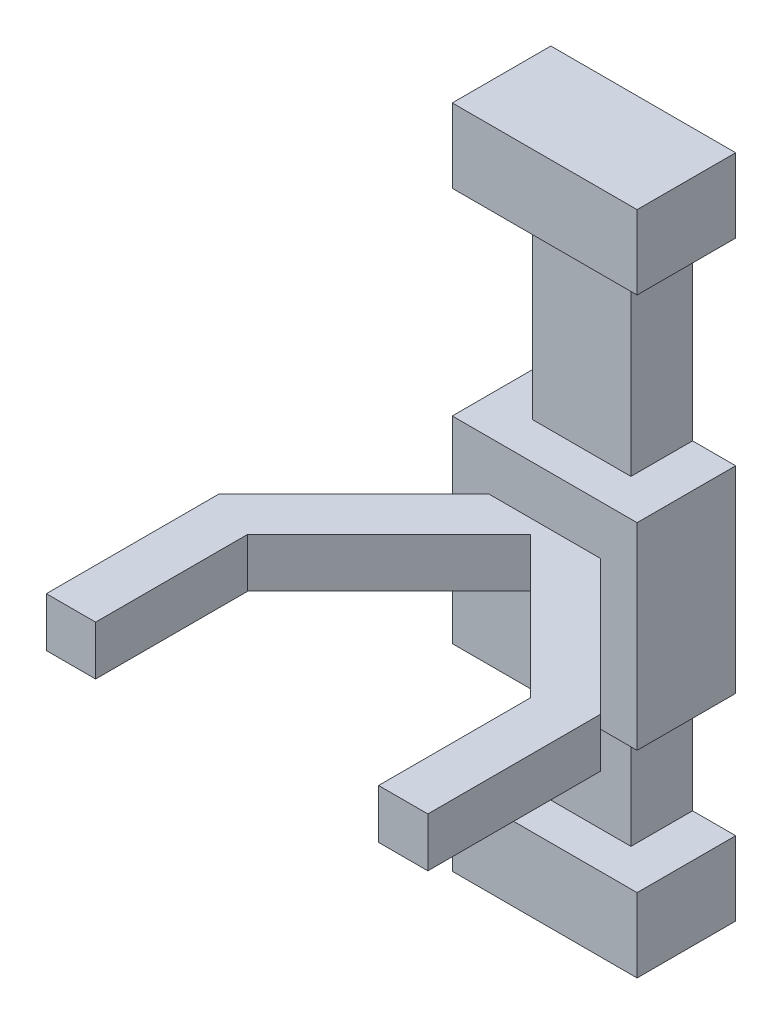
ISO-10303-21;
HEADER;
FILE_DESCRIPTION(('STEP AP214'),'2;1');
FILE_NAME('part.step','',(''),(''),'','','');
FILE_SCHEMA(('AUTOMOTIVE_DESIGN { 1 0 10303 214 1 1 1 1 }'));
ENDSEC;
DATA;
#1=APPLICATION_CONTEXT('core data for automotive mechanical design processes');
#2=APPLICATION_PROTOCOL_DEFINITION('international standard','automotive_design',2000,#1);
#3=PRODUCT_CONTEXT('',#1,'mechanical');
#4=PRODUCT('Part','Part','',(#3));
#5=PRODUCT_RELATED_PRODUCT_CATEGORY('part','',(#4));
#6=PRODUCT_DEFINITION_FORMATION('','',#4);
#7=PRODUCT_DEFINITION_CONTEXT('part definition',#1,'design');
#8=PRODUCT_DEFINITION('design','',#6,#7);
#9=PRODUCT_DEFINITION_SHAPE('','',#8);
#10=(LENGTH_UNIT() NAMED_UNIT(*) SI_UNIT(.MILLI.,.METRE.));
#11=(NAMED_UNIT(*) PLANE_ANGLE_UNIT() SI_UNIT($,.RADIAN.));
#12=(NAMED_UNIT(*) SI_UNIT($,.STERADIAN.) SOLID_ANGLE_UNIT());
#13=UNCERTAINTY_MEASURE_WITH_UNIT(LENGTH_MEASURE(1.E-05),#10,'distance_accuracy_value','');
#14=(GEOMETRIC_REPRESENTATION_CONTEXT(3) GLOBAL_UNCERTAINTY_ASSIGNED_CONTEXT((#13)) GLOBAL_UNIT_ASSIGNED_CONTEXT((#10,
#11,#12)) REPRESENTATION_CONTEXT('',''));
#15=CARTESIAN_POINT('',(0.,0.,0.));
#16=DIRECTION('',(0.,0.,1.));
#17=DIRECTION('',(1.,0.,0.));
#18=AXIS2_PLACEMENT_3D('',#15,#16,#17);
#19=CARTESIAN_POINT('',(83.262716319083,0.,108.942911165688));
#20=DIRECTION('',(-0.707106781186547,0.,0.707106781186547));
#21=DIRECTION('',(0.707106781186548,0.,0.707106781186547));
#22=AXIS2_PLACEMENT_3D('',#19,#20,#21);
#23=PLANE('',#22);
#24=DIRECTION('',(-0.707106781186547,0.,-0.707106781186547));
#25=VECTOR('',#24,1.);
#26=CARTESIAN_POINT('',(83.262716319083,90.,108.942911165688));
#27=LINE('',#26,#25);
#28=CARTESIAN_POINT('',(77.404851942814,90.,103.085046789419));
#29=VERTEX_POINT('',#28);
#30=CARTESIAN_POINT('',(20.,90.,45.6801948466053));
#31=VERTEX_POINT('',#30);
#32=EDGE_CURVE('E55',#29,#31,#27,.T.);
#33=ORIENTED_EDGE('',*,*,#32,.F.);
#34=DIRECTION('',(0.,1.,0.));
#35=VECTOR('',#34,1.);
#36=CARTESIAN_POINT('',(77.404851942814,0.,103.085046789419));
#37=LINE('',#36,#35);
#38=CARTESIAN_POINT('',(77.404851942814,110.,103.085046789419));
#39=VERTEX_POINT('',#38);
#40=EDGE_CURVE('E59',#29,#39,#37,.T.);
#41=ORIENTED_EDGE('',*,*,#40,.T.);
#42=DIRECTION('',(-0.707106781186547,0.,-0.707106781186547));
#43=VECTOR('',#42,1.);
#44=CARTESIAN_POINT('',(83.262716319083,110.,108.942911165688));
#45=LINE('',#44,#43);
#46=CARTESIAN_POINT('',(19.9999999999999,110.,45.6801948466053));
#47=VERTEX_POINT('',#46);
#48=EDGE_CURVE('E329',#39,#47,#45,.T.);
#49=ORIENTED_EDGE('',*,*,#48,.T.);
#50=DIRECTION('',(0.,1.,0.));
#51=VECTOR('',#50,1.);
#52=CARTESIAN_POINT('',(20.,0.,45.6801948466053));
#53=LINE('',#52,#51);
#54=EDGE_CURVE('E323',#31,#47,#53,.T.);
#55=ORIENTED_EDGE('',*,*,#54,.F.);
#56=EDGE_LOOP('',(#33,#41,#49,#55));
#57=FACE_BOUND('',#56,.T.);
#58=ADVANCED_FACE('F39',(#57),#23,.T.);
#59=CARTESIAN_POINT('',(-43.262716319083,0.,108.942911165688));
#60=DIRECTION('',(0.707106781186547,0.,0.707106781186547));
#61=DIRECTION('',(0.707106781186548,0.,-0.707106781186547));
#62=AXIS2_PLACEMENT_3D('',#59,#60,#61);
#63=PLANE('',#62);
#64=DIRECTION('',(0.707106781186547,0.,-0.707106781186547));
#65=VECTOR('',#64,1.);
#66=CARTESIAN_POINT('',(-43.262716319083,110.,108.942911165688));
#67=LINE('',#66,#65);
#68=CARTESIAN_POINT('',(-37.404851942814,110.,103.085046789419));
#69=VERTEX_POINT('',#68);
#70=EDGE_CURVE('E319',#69,#47,#67,.T.);
#71=ORIENTED_EDGE('',*,*,#70,.F.);
#72=DIRECTION('',(0.,-1.,0.));
#73=VECTOR('',#72,1.);
#74=CARTESIAN_POINT('',(-37.404851942814,0.,103.085046789419));
#75=LINE('',#74,#73);
#76=CARTESIAN_POINT('',(-37.404851942814,90.,103.085046789419));
#77=VERTEX_POINT('',#76);
#78=EDGE_CURVE('E11',#69,#77,#75,.T.);
#79=ORIENTED_EDGE('',*,*,#78,.T.);
#80=DIRECTION('',(0.707106781186547,0.,-0.707106781186547));
#81=VECTOR('',#80,1.);
#82=CARTESIAN_POINT('',(-43.262716319083,90.,108.942911165688));
#83=LINE('',#82,#81);
#84=EDGE_CURVE('E307',#77,#31,#83,.T.);
#85=ORIENTED_EDGE('',*,*,#84,.T.);
#86=ORIENTED_EDGE('',*,*,#54,.T.);
#87=EDGE_LOOP('',(#71,#79,#85,#86));
#88=FACE_BOUND('',#87,.T.);
#89=ADVANCED_FACE('F583',(#88),#63,.T.);
#90=CARTESIAN_POINT('',(0.,0.,25.));
#91=DIRECTION('',(1.,0.,0.));
#92=DIRECTION('',(0.,0.,-1.));
#93=AXIS2_PLACEMENT_3D('',#90,#91,#92);
#94=PLANE('',#93);
#95=DIRECTION('',(0.,0.,1.));
#96=VECTOR('',#95,1.);
#97=CARTESIAN_POINT('',(0.,50.,25.));
#98=LINE('',#97,#96);
#99=CARTESIAN_POINT('',(0.,50.,0.));
#100=VERTEX_POINT('',#99);
#101=CARTESIAN_POINT('',(0.,50.,25.));
#102=VERTEX_POINT('',#101);
#103=EDGE_CURVE('E396',#100,#102,#98,.T.);
#104=ORIENTED_EDGE('',*,*,#103,.F.);
#105=DIRECTION('',(0.,-1.,0.));
#106=VECTOR('',#105,1.);
#107=CARTESIAN_POINT('',(0.,0.,0.));
#108=LINE('',#107,#106);
#109=CARTESIAN_POINT('',(0.,0.,0.));
#110=VERTEX_POINT('',#109);
#111=EDGE_CURVE('E499',#100,#110,#108,.T.);
#112=ORIENTED_EDGE('',*,*,#111,.T.);
#113=DIRECTION('',(0.,0.,-1.));
#114=VECTOR('',#113,1.);
#115=CARTESIAN_POINT('',(0.,0.,25.));
#116=LINE('',#115,#114);
#117=CARTESIAN_POINT('',(0.,0.,25.));
#118=VERTEX_POINT('',#117);
#119=EDGE_CURVE('E532',#118,#110,#116,.T.);
#120=ORIENTED_EDGE('',*,*,#119,.F.);
#121=DIRECTION('',(0.,-1.,0.));
#122=VECTOR('',#121,1.);
#123=CARTESIAN_POINT('',(0.,0.,25.));
#124=LINE('',#123,#122);
#125=EDGE_CURVE('E505',#102,#118,#124,.T.);
#126=ORIENTED_EDGE('',*,*,#125,.F.);
#127=EDGE_LOOP('',(#104,#112,#120,#126));
#128=FACE_BOUND('',#127,.T.);
#129=ADVANCED_FACE('F604',(#128),#94,.F.);
#130=CARTESIAN_POINT('',(40.,0.,25.));
#131=DIRECTION('',(-1.,0.,0.));
#132=DIRECTION('',(0.,0.,1.));
#133=AXIS2_PLACEMENT_3D('',#130,#131,#132);
#134=PLANE('',#133);
#135=DIRECTION('',(0.,0.,-1.));
#136=VECTOR('',#135,1.);
#137=CARTESIAN_POINT('',(40.,50.,25.));
#138=LINE('',#137,#136);
#139=CARTESIAN_POINT('',(40.,50.,25.));
#140=VERTEX_POINT('',#139);
#141=CARTESIAN_POINT('',(40.,50.,0.));
#142=VERTEX_POINT('',#141);
#143=EDGE_CURVE('E392',#140,#142,#138,.T.);
#144=ORIENTED_EDGE('',*,*,#143,.F.);
#145=DIRECTION('',(0.,1.,0.));
#146=VECTOR('',#145,1.);
#147=CARTESIAN_POINT('',(40.,0.,25.));
#148=LINE('',#147,#146);
#149=CARTESIAN_POINT('',(40.,0.,25.));
#150=VERTEX_POINT('',#149);
#151=EDGE_CURVE('E509',#150,#140,#148,.T.);
#152=ORIENTED_EDGE('',*,*,#151,.F.);
#153=DIRECTION('',(0.,0.,-1.));
#154=VECTOR('',#153,1.);
#155=CARTESIAN_POINT('',(40.,0.,25.));
#156=LINE('',#155,#154);
#157=CARTESIAN_POINT('',(40.,0.,0.));
#158=VERTEX_POINT('',#157);
#159=EDGE_CURVE('E529',#150,#158,#156,.T.);
#160=ORIENTED_EDGE('',*,*,#159,.T.);
#161=DIRECTION('',(0.,1.,0.));
#162=VECTOR('',#161,1.);
#163=CARTESIAN_POINT('',(40.,0.,0.));
#164=LINE('',#163,#162);
#165=EDGE_CURVE('E520',#158,#142,#164,.T.);
#166=ORIENTED_EDGE('',*,*,#165,.T.);
#167=EDGE_LOOP('',(#144,#152,#160,#166));
#168=FACE_BOUND('',#167,.T.);
#169=ADVANCED_FACE('F678',(#168),#134,.F.);
#170=CARTESIAN_POINT('',(0.,0.,25.));
#171=DIRECTION('',(0.,0.,-1.));
#172=DIRECTION('',(-1.,0.,0.));
#173=AXIS2_PLACEMENT_3D('',#170,#171,#172);
#174=PLANE('',#173);
#175=DIRECTION('',(1.,0.,0.));
#176=VECTOR('',#175,1.);
#177=CARTESIAN_POINT('',(0.,50.,25.));
#178=LINE('',#177,#176);
#179=EDGE_CURVE('E388',#102,#140,#178,.T.);
#180=ORIENTED_EDGE('',*,*,#179,.F.);
#181=ORIENTED_EDGE('',*,*,#125,.T.);
#182=DIRECTION('',(1.,0.,0.));
#183=VECTOR('',#182,1.);
#184=CARTESIAN_POINT('',(0.,0.,25.));
#185=LINE('',#184,#183);
#186=EDGE_CURVE('E504',#118,#150,#185,.T.);
#187=ORIENTED_EDGE('',*,*,#186,.T.);
#188=ORIENTED_EDGE('',*,*,#151,.T.);
#189=EDGE_LOOP('',(#180,#181,#187,#188));
#190=FACE_BOUND('',#189,.T.);
#191=ADVANCED_FACE('F673',(#190),#174,.F.);
#192=CARTESIAN_POINT('',(0.,210.,0.));
#193=VERTEX_POINT('',#192);
#194=CARTESIAN_POINT('',(0.,130.,0.));
#195=VERTEX_POINT('',#194);
#196=EDGE_CURVE('E516',#193,#195,#108,.T.);
#197=ORIENTED_EDGE('',*,*,#196,.T.);
#198=DIRECTION('',(0.,0.,1.));
#199=VECTOR('',#198,1.);
#200=CARTESIAN_POINT('',(0.,130.,25.));
#201=LINE('',#200,#199);
#202=CARTESIAN_POINT('',(0.,130.,25.));
#203=VERTEX_POINT('',#202);
#204=EDGE_CURVE('E406',#195,#203,#201,.T.);
#205=ORIENTED_EDGE('',*,*,#204,.T.);
#206=CARTESIAN_POINT('',(0.,210.,25.));
#207=VERTEX_POINT('',#206);
#208=EDGE_CURVE('E500',#207,#203,#124,.T.);
#209=ORIENTED_EDGE('',*,*,#208,.F.);
#210=DIRECTION('',(0.,0.,-1.));
#211=VECTOR('',#210,1.);
#212=CARTESIAN_POINT('',(0.,210.,25.));
#213=LINE('',#212,#211);
#214=EDGE_CURVE('E515',#207,#193,#213,.T.);
#215=ORIENTED_EDGE('',*,*,#214,.T.);
#216=EDGE_LOOP('',(#197,#205,#209,#215));
#217=FACE_BOUND('',#216,.T.);
#218=ADVANCED_FACE('F41',(#217),#94,.F.);
#219=CARTESIAN_POINT('',(40.,130.,25.));
#220=VERTEX_POINT('',#219);
#221=CARTESIAN_POINT('',(40.,210.,25.));
#222=VERTEX_POINT('',#221);
#223=EDGE_CURVE('E508',#220,#222,#148,.T.);
#224=ORIENTED_EDGE('',*,*,#223,.F.);
#225=DIRECTION('',(0.,0.,-1.));
#226=VECTOR('',#225,1.);
#227=CARTESIAN_POINT('',(40.,130.,25.));
#228=LINE('',#227,#226);
#229=CARTESIAN_POINT('',(40.,130.,0.));
#230=VERTEX_POINT('',#229);
#231=EDGE_CURVE('E403',#220,#230,#228,.T.);
#232=ORIENTED_EDGE('',*,*,#231,.T.);
#233=CARTESIAN_POINT('',(40.,210.,0.));
#234=VERTEX_POINT('',#233);
#235=EDGE_CURVE('E519',#230,#234,#164,.T.);
#236=ORIENTED_EDGE('',*,*,#235,.T.);
#237=DIRECTION('',(0.,0.,-1.));
#238=VECTOR('',#237,1.);
#239=CARTESIAN_POINT('',(40.,210.,25.));
#240=LINE('',#239,#238);
#241=EDGE_CURVE('E525',#222,#234,#240,.T.);
#242=ORIENTED_EDGE('',*,*,#241,.F.);
#243=EDGE_LOOP('',(#224,#232,#236,#242));
#244=FACE_BOUND('',#243,.T.);
#245=ADVANCED_FACE('F671',(#244),#134,.F.);
#246=ORIENTED_EDGE('',*,*,#208,.T.);
#247=DIRECTION('',(1.,0.,0.));
#248=VECTOR('',#247,1.);
#249=CARTESIAN_POINT('',(0.,130.,25.));
#250=LINE('',#249,#248);
#251=EDGE_CURVE('E400',#203,#220,#250,.T.);
#252=ORIENTED_EDGE('',*,*,#251,.T.);
#253=ORIENTED_EDGE('',*,*,#223,.T.);
#254=DIRECTION('',(-1.,0.,0.));
#255=VECTOR('',#254,1.);
#256=CARTESIAN_POINT('',(0.,210.,25.));
#257=LINE('',#256,#255);
#258=EDGE_CURVE('E512',#222,#207,#257,.T.);
#259=ORIENTED_EDGE('',*,*,#258,.T.);
#260=EDGE_LOOP('',(#246,#252,#253,#259));
#261=FACE_BOUND('',#260,.T.);
#262=ADVANCED_FACE('F668',(#261),#174,.F.);
#263=CARTESIAN_POINT('',(0.,0.,0.));
#264=DIRECTION('',(0.,0.,-1.));
#265=DIRECTION('',(-1.,0.,0.));
#266=AXIS2_PLACEMENT_3D('',#263,#264,#265);
#267=PLANE('',#266);
#268=ORIENTED_EDGE('',*,*,#235,.F.);
#269=DIRECTION('',(1.,0.,0.));
#270=VECTOR('',#269,1.);
#271=CARTESIAN_POINT('',(0.,130.,0.));
#272=LINE('',#271,#270);
#273=CARTESIAN_POINT('',(57.5,130.,0.));
#274=VERTEX_POINT('',#273);
#275=EDGE_CURVE('E351',#230,#274,#272,.T.);
#276=ORIENTED_EDGE('',*,*,#275,.T.);
#277=DIRECTION('',(0.,-1.,0.));
#278=VECTOR('',#277,1.);
#279=CARTESIAN_POINT('',(57.5,130.,0.));
#280=LINE('',#279,#278);
#281=CARTESIAN_POINT('',(57.5,50.,0.));
#282=VERTEX_POINT('',#281);
#283=EDGE_CURVE('E380',#274,#282,#280,.T.);
#284=ORIENTED_EDGE('',*,*,#283,.T.);
#285=DIRECTION('',(1.,0.,0.));
#286=VECTOR('',#285,1.);
#287=CARTESIAN_POINT('',(0.,50.,0.));
#288=LINE('',#287,#286);
#289=EDGE_CURVE('E367',#142,#282,#288,.T.);
#290=ORIENTED_EDGE('',*,*,#289,.F.);
#291=ORIENTED_EDGE('',*,*,#165,.F.);
#292=DIRECTION('',(-1.,0.,0.));
#293=VECTOR('',#292,1.);
#294=CARTESIAN_POINT('',(0.,0.,0.));
#295=LINE('',#294,#293);
#296=CARTESIAN_POINT('',(57.5,0.,0.));
#297=VERTEX_POINT('',#296);
#298=EDGE_CURVE('E428',#297,#158,#295,.T.);
#299=ORIENTED_EDGE('',*,*,#298,.F.);
#300=DIRECTION('',(0.,1.,0.));
#301=VECTOR('',#300,1.);
#302=CARTESIAN_POINT('',(57.5,-30.,0.));
#303=LINE('',#302,#301);
#304=CARTESIAN_POINT('',(57.5,-30.,0.));
#305=VERTEX_POINT('',#304);
#306=EDGE_CURVE('E452',#305,#297,#303,.T.);
#307=ORIENTED_EDGE('',*,*,#306,.F.);
#308=DIRECTION('',(-1.,0.,0.));
#309=VECTOR('',#308,1.);
#310=CARTESIAN_POINT('',(0.,-30.,0.));
#311=LINE('',#310,#309);
#312=CARTESIAN_POINT('',(-17.5,-30.,0.));
#313=VERTEX_POINT('',#312);
#314=EDGE_CURVE('E410',#305,#313,#311,.T.);
#315=ORIENTED_EDGE('',*,*,#314,.T.);
#316=DIRECTION('',(0.,1.,0.));
#317=VECTOR('',#316,1.);
#318=CARTESIAN_POINT('',(-17.5,-30.,0.));
#319=LINE('',#318,#317);
#320=CARTESIAN_POINT('',(-17.5,0.,0.));
#321=VERTEX_POINT('',#320);
#322=EDGE_CURVE('E427',#313,#321,#319,.T.);
#323=ORIENTED_EDGE('',*,*,#322,.T.);
#324=EDGE_CURVE('E409',#110,#321,#295,.T.);
#325=ORIENTED_EDGE('',*,*,#324,.F.);
#326=ORIENTED_EDGE('',*,*,#111,.F.);
#327=CARTESIAN_POINT('',(-17.5,50.,0.));
#328=VERTEX_POINT('',#327);
#329=EDGE_CURVE('E368',#328,#100,#288,.T.);
#330=ORIENTED_EDGE('',*,*,#329,.F.);
#331=DIRECTION('',(0.,-1.,0.));
#332=VECTOR('',#331,1.);
#333=CARTESIAN_POINT('',(-17.5,130.,0.));
#334=LINE('',#333,#332);
#335=CARTESIAN_POINT('',(-17.5,130.,0.));
#336=VERTEX_POINT('',#335);
#337=EDGE_CURVE('E377',#336,#328,#334,.T.);
#338=ORIENTED_EDGE('',*,*,#337,.F.);
#339=EDGE_CURVE('E352',#336,#195,#272,.T.);
#340=ORIENTED_EDGE('',*,*,#339,.T.);
#341=ORIENTED_EDGE('',*,*,#196,.F.);
#342=DIRECTION('',(-1.,0.,0.));
#343=VECTOR('',#342,1.);
#344=CARTESIAN_POINT('',(0.,210.,0.));
#345=LINE('',#344,#343);
#346=CARTESIAN_POINT('',(-17.5,210.,0.));
#347=VERTEX_POINT('',#346);
#348=EDGE_CURVE('E475',#193,#347,#345,.T.);
#349=ORIENTED_EDGE('',*,*,#348,.T.);
#350=DIRECTION('',(0.,-1.,0.));
#351=VECTOR('',#350,1.);
#352=CARTESIAN_POINT('',(-17.5,240.,0.));
#353=LINE('',#352,#351);
#354=CARTESIAN_POINT('',(-17.5,240.,0.));
#355=VERTEX_POINT('',#354);
#356=EDGE_CURVE('E492',#355,#347,#353,.T.);
#357=ORIENTED_EDGE('',*,*,#356,.F.);
#358=DIRECTION('',(-1.,0.,0.));
#359=VECTOR('',#358,1.);
#360=CARTESIAN_POINT('',(0.,240.,0.));
#361=LINE('',#360,#359);
#362=CARTESIAN_POINT('',(57.5,240.,0.));
#363=VERTEX_POINT('',#362);
#364=EDGE_CURVE('E460',#363,#355,#361,.T.);
#365=ORIENTED_EDGE('',*,*,#364,.F.);
#366=DIRECTION('',(0.,-1.,0.));
#367=VECTOR('',#366,1.);
#368=CARTESIAN_POINT('',(57.5,240.,0.));
#369=LINE('',#368,#367);
#370=CARTESIAN_POINT('',(57.5,210.,0.));
#371=VERTEX_POINT('',#370);
#372=EDGE_CURVE('E496',#363,#371,#369,.T.);
#373=ORIENTED_EDGE('',*,*,#372,.T.);
#374=EDGE_CURVE('E476',#371,#234,#345,.T.);
#375=ORIENTED_EDGE('',*,*,#374,.T.);
#376=EDGE_LOOP('',(#268,#276,#284,#290,#291,#299,#307,#315,#323,#325,#326,#330,#338,#340,#341,
#349,#357,#365,#373,#375));
#377=FACE_BOUND('',#376,.T.);
#378=ADVANCED_FACE('F666',(#377),#267,.T.);
#379=CARTESIAN_POINT('',(57.5,240.,0.));
#380=DIRECTION('',(1.,0.,0.));
#381=DIRECTION('',(0.,0.,-1.));
#382=AXIS2_PLACEMENT_3D('',#379,#380,#381);
#383=PLANE('',#382);
#384=DIRECTION('',(0.,0.,1.));
#385=VECTOR('',#384,1.);
#386=CARTESIAN_POINT('',(57.5,210.,0.));
#387=LINE('',#386,#385);
#388=CARTESIAN_POINT('',(57.5,210.,40.));
#389=VERTEX_POINT('',#388);
#390=EDGE_CURVE('E455',#371,#389,#387,.T.);
#391=ORIENTED_EDGE('',*,*,#390,.F.);
#392=ORIENTED_EDGE('',*,*,#372,.F.);
#393=DIRECTION('',(0.,0.,1.));
#394=VECTOR('',#393,1.);
#395=CARTESIAN_POINT('',(57.5,240.,0.));
#396=LINE('',#395,#394);
#397=CARTESIAN_POINT('',(57.5,240.,40.));
#398=VERTEX_POINT('',#397);
#399=EDGE_CURVE('E456',#363,#398,#396,.T.);
#400=ORIENTED_EDGE('',*,*,#399,.T.);
#401=DIRECTION('',(0.,-1.,0.));
#402=VECTOR('',#401,1.);
#403=CARTESIAN_POINT('',(57.5,240.,40.));
#404=LINE('',#403,#402);
#405=EDGE_CURVE('E471',#398,#389,#404,.T.);
#406=ORIENTED_EDGE('',*,*,#405,.T.);
#407=EDGE_LOOP('',(#391,#392,#400,#406));
#408=FACE_BOUND('',#407,.T.);
#409=ADVANCED_FACE('F662',(#408),#383,.T.);
#410=CARTESIAN_POINT('',(-17.5,240.,0.));
#411=DIRECTION('',(1.,0.,0.));
#412=DIRECTION('',(0.,0.,-1.));
#413=AXIS2_PLACEMENT_3D('',#410,#411,#412);
#414=PLANE('',#413);
#415=DIRECTION('',(0.,0.,1.));
#416=VECTOR('',#415,1.);
#417=CARTESIAN_POINT('',(-17.5,210.,0.));
#418=LINE('',#417,#416);
#419=CARTESIAN_POINT('',(-17.5,210.,40.));
#420=VERTEX_POINT('',#419);
#421=EDGE_CURVE('E480',#347,#420,#418,.T.);
#422=ORIENTED_EDGE('',*,*,#421,.T.);
#423=DIRECTION('',(0.,-1.,0.));
#424=VECTOR('',#423,1.);
#425=CARTESIAN_POINT('',(-17.5,240.,40.));
#426=LINE('',#425,#424);
#427=CARTESIAN_POINT('',(-17.5,240.,40.));
#428=VERTEX_POINT('',#427);
#429=EDGE_CURVE('E489',#428,#420,#426,.T.);
#430=ORIENTED_EDGE('',*,*,#429,.F.);
#431=DIRECTION('',(0.,0.,1.));
#432=VECTOR('',#431,1.);
#433=CARTESIAN_POINT('',(-17.5,240.,0.));
#434=LINE('',#433,#432);
#435=EDGE_CURVE('E464',#355,#428,#434,.T.);
#436=ORIENTED_EDGE('',*,*,#435,.F.);
#437=ORIENTED_EDGE('',*,*,#356,.T.);
#438=EDGE_LOOP('',(#422,#430,#436,#437));
#439=FACE_BOUND('',#438,.T.);
#440=ADVANCED_FACE('F658',(#439),#414,.F.);
#441=CARTESIAN_POINT('',(0.,240.,40.));
#442=DIRECTION('',(0.,0.,1.));
#443=DIRECTION('',(1.,0.,0.));
#444=AXIS2_PLACEMENT_3D('',#441,#442,#443);
#445=PLANE('',#444);
#446=DIRECTION('',(-1.,0.,0.));
#447=VECTOR('',#446,1.);
#448=CARTESIAN_POINT('',(0.,210.,40.));
#449=LINE('',#448,#447);
#450=EDGE_CURVE('E461',#389,#420,#449,.T.);
#451=ORIENTED_EDGE('',*,*,#450,.F.);
#452=ORIENTED_EDGE('',*,*,#405,.F.);
#453=DIRECTION('',(-1.,0.,0.));
#454=VECTOR('',#453,1.);
#455=CARTESIAN_POINT('',(0.,240.,40.));
#456=LINE('',#455,#454);
#457=EDGE_CURVE('E467',#398,#428,#456,.T.);
#458=ORIENTED_EDGE('',*,*,#457,.T.);
#459=ORIENTED_EDGE('',*,*,#429,.T.);
#460=EDGE_LOOP('',(#451,#452,#458,#459));
#461=FACE_BOUND('',#460,.T.);
#462=ADVANCED_FACE('F651',(#461),#445,.T.);
#463=CARTESIAN_POINT('',(0.,240.,0.));
#464=DIRECTION('',(0.,1.,0.));
#465=DIRECTION('',(0.,0.,1.));
#466=AXIS2_PLACEMENT_3D('',#463,#464,#465);
#467=PLANE('',#466);
#468=ORIENTED_EDGE('',*,*,#399,.F.);
#469=ORIENTED_EDGE('',*,*,#364,.T.);
#470=ORIENTED_EDGE('',*,*,#435,.T.);
#471=ORIENTED_EDGE('',*,*,#457,.F.);
#472=EDGE_LOOP('',(#468,#469,#470,#471));
#473=FACE_BOUND('',#472,.T.);
#474=ADVANCED_FACE('F648',(#473),#467,.T.);
#475=CARTESIAN_POINT('',(0.,210.,0.));
#476=DIRECTION('',(0.,1.,0.));
#477=DIRECTION('',(0.,0.,1.));
#478=AXIS2_PLACEMENT_3D('',#475,#476,#477);
#479=PLANE('',#478);
#480=ORIENTED_EDGE('',*,*,#214,.F.);
#481=ORIENTED_EDGE('',*,*,#258,.F.);
#482=ORIENTED_EDGE('',*,*,#241,.T.);
#483=ORIENTED_EDGE('',*,*,#374,.F.);
#484=ORIENTED_EDGE('',*,*,#390,.T.);
#485=ORIENTED_EDGE('',*,*,#450,.T.);
#486=ORIENTED_EDGE('',*,*,#421,.F.);
#487=ORIENTED_EDGE('',*,*,#348,.F.);
#488=EDGE_LOOP('',(#480,#481,#482,#483,#484,#485,#486,#487));
#489=FACE_BOUND('',#488,.T.);
#490=ADVANCED_FACE('F646',(#489),#479,.F.);
#491=CARTESIAN_POINT('',(57.5,-30.,0.));
#492=DIRECTION('',(1.,0.,0.));
#493=DIRECTION('',(0.,0.,-1.));
#494=AXIS2_PLACEMENT_3D('',#491,#492,#493);
#495=PLANE('',#494);
#496=DIRECTION('',(0.,0.,-1.));
#497=VECTOR('',#496,1.);
#498=CARTESIAN_POINT('',(57.5,0.,0.));
#499=LINE('',#498,#497);
#500=CARTESIAN_POINT('',(57.5,0.,40.));
#501=VERTEX_POINT('',#500);
#502=EDGE_CURVE('E432',#501,#297,#499,.T.);
#503=ORIENTED_EDGE('',*,*,#502,.F.);
#504=DIRECTION('',(0.,1.,0.));
#505=VECTOR('',#504,1.);
#506=CARTESIAN_POINT('',(57.5,-30.,40.));
#507=LINE('',#506,#505);
#508=CARTESIAN_POINT('',(57.5,-30.,40.));
#509=VERTEX_POINT('',#508);
#510=EDGE_CURVE('E449',#509,#501,#507,.T.);
#511=ORIENTED_EDGE('',*,*,#510,.F.);
#512=DIRECTION('',(0.,0.,-1.));
#513=VECTOR('',#512,1.);
#514=CARTESIAN_POINT('',(57.5,-30.,0.));
#515=LINE('',#514,#513);
#516=EDGE_CURVE('E414',#509,#305,#515,.T.);
#517=ORIENTED_EDGE('',*,*,#516,.T.);
#518=ORIENTED_EDGE('',*,*,#306,.T.);
#519=EDGE_LOOP('',(#503,#511,#517,#518));
#520=FACE_BOUND('',#519,.T.);
#521=ADVANCED_FACE('F642',(#520),#495,.T.);
#522=CARTESIAN_POINT('',(0.,-30.,40.));
#523=DIRECTION('',(0.,0.,1.));
#524=DIRECTION('',(1.,0.,0.));
#525=AXIS2_PLACEMENT_3D('',#522,#523,#524);
#526=PLANE('',#525);
#527=DIRECTION('',(1.,0.,0.));
#528=VECTOR('',#527,1.);
#529=CARTESIAN_POINT('',(0.,0.,40.));
#530=LINE('',#529,#528);
#531=CARTESIAN_POINT('',(-17.5,0.,40.));
#532=VERTEX_POINT('',#531);
#533=EDGE_CURVE('E436',#532,#501,#530,.T.);
#534=ORIENTED_EDGE('',*,*,#533,.F.);
#535=DIRECTION('',(0.,1.,0.));
#536=VECTOR('',#535,1.);
#537=CARTESIAN_POINT('',(-17.5,-30.,40.));
#538=LINE('',#537,#536);
#539=CARTESIAN_POINT('',(-17.5,-30.,40.));
#540=VERTEX_POINT('',#539);
#541=EDGE_CURVE('E446',#540,#532,#538,.T.);
#542=ORIENTED_EDGE('',*,*,#541,.F.);
#543=DIRECTION('',(1.,0.,0.));
#544=VECTOR('',#543,1.);
#545=CARTESIAN_POINT('',(0.,-30.,40.));
#546=LINE('',#545,#544);
#547=EDGE_CURVE('E419',#540,#509,#546,.T.);
#548=ORIENTED_EDGE('',*,*,#547,.T.);
#549=ORIENTED_EDGE('',*,*,#510,.T.);
#550=EDGE_LOOP('',(#534,#542,#548,#549));
#551=FACE_BOUND('',#550,.T.);
#552=ADVANCED_FACE('F638',(#551),#526,.T.);
#553=CARTESIAN_POINT('',(-17.5,-30.,0.));
#554=DIRECTION('',(-1.,0.,0.));
#555=DIRECTION('',(0.,0.,1.));
#556=AXIS2_PLACEMENT_3D('',#553,#554,#555);
#557=PLANE('',#556);
#558=DIRECTION('',(0.,0.,1.));
#559=VECTOR('',#558,1.);
#560=CARTESIAN_POINT('',(-17.5,0.,0.));
#561=LINE('',#560,#559);
#562=EDGE_CURVE('E415',#321,#532,#561,.T.);
#563=ORIENTED_EDGE('',*,*,#562,.F.);
#564=ORIENTED_EDGE('',*,*,#322,.F.);
#565=DIRECTION('',(0.,0.,1.));
#566=VECTOR('',#565,1.);
#567=CARTESIAN_POINT('',(-17.5,-30.,0.));
#568=LINE('',#567,#566);
#569=EDGE_CURVE('E423',#313,#540,#568,.T.);
#570=ORIENTED_EDGE('',*,*,#569,.T.);
#571=ORIENTED_EDGE('',*,*,#541,.T.);
#572=EDGE_LOOP('',(#563,#564,#570,#571));
#573=FACE_BOUND('',#572,.T.);
#574=ADVANCED_FACE('F631',(#573),#557,.T.);
#575=CARTESIAN_POINT('',(0.,-30.,0.));
#576=DIRECTION('',(0.,-1.,0.));
#577=DIRECTION('',(0.,0.,-1.));
#578=AXIS2_PLACEMENT_3D('',#575,#576,#577);
#579=PLANE('',#578);
#580=ORIENTED_EDGE('',*,*,#314,.F.);
#581=ORIENTED_EDGE('',*,*,#516,.F.);
#582=ORIENTED_EDGE('',*,*,#547,.F.);
#583=ORIENTED_EDGE('',*,*,#569,.F.);
#584=EDGE_LOOP('',(#580,#581,#582,#583));
#585=FACE_BOUND('',#584,.T.);
#586=ADVANCED_FACE('F628',(#585),#579,.T.);
#587=CARTESIAN_POINT('',(0.,0.,0.));
#588=DIRECTION('',(0.,-1.,0.));
#589=DIRECTION('',(0.,0.,-1.));
#590=AXIS2_PLACEMENT_3D('',#587,#588,#589);
#591=PLANE('',#590);
#592=ORIENTED_EDGE('',*,*,#159,.F.);
#593=ORIENTED_EDGE('',*,*,#186,.F.);
#594=ORIENTED_EDGE('',*,*,#119,.T.);
#595=ORIENTED_EDGE('',*,*,#324,.T.);
#596=ORIENTED_EDGE('',*,*,#562,.T.);
#597=ORIENTED_EDGE('',*,*,#533,.T.);
#598=ORIENTED_EDGE('',*,*,#502,.T.);
#599=ORIENTED_EDGE('',*,*,#298,.T.);
#600=EDGE_LOOP('',(#592,#593,#594,#595,#596,#597,#598,#599));
#601=FACE_BOUND('',#600,.T.);
#602=ADVANCED_FACE('F613',(#601),#591,.F.);
#603=CARTESIAN_POINT('',(0.,130.,0.));
#604=DIRECTION('',(0.,1.,0.));
#605=DIRECTION('',(0.,0.,1.));
#606=AXIS2_PLACEMENT_3D('',#603,#604,#605);
#607=PLANE('',#606);
#608=ORIENTED_EDGE('',*,*,#204,.F.);
#609=ORIENTED_EDGE('',*,*,#339,.F.);
#610=DIRECTION('',(0.,0.,1.));
#611=VECTOR('',#610,1.);
#612=CARTESIAN_POINT('',(-17.5,130.,0.));
#613=LINE('',#612,#611);
#614=CARTESIAN_POINT('',(-17.5,130.,40.));
#615=VERTEX_POINT('',#614);
#616=EDGE_CURVE('E356',#336,#615,#613,.T.);
#617=ORIENTED_EDGE('',*,*,#616,.T.);
#618=DIRECTION('',(1.,0.,0.));
#619=VECTOR('',#618,1.);
#620=CARTESIAN_POINT('',(0.,130.,40.));
#621=LINE('',#620,#619);
#622=CARTESIAN_POINT('',(57.5,130.,40.));
#623=VERTEX_POINT('',#622);
#624=EDGE_CURVE('E342',#615,#623,#621,.T.);
#625=ORIENTED_EDGE('',*,*,#624,.T.);
#626=DIRECTION('',(0.,0.,-1.));
#627=VECTOR('',#626,1.);
#628=CARTESIAN_POINT('',(57.5,130.,0.));
#629=LINE('',#628,#627);
#630=EDGE_CURVE('E346',#623,#274,#629,.T.);
#631=ORIENTED_EDGE('',*,*,#630,.T.);
#632=ORIENTED_EDGE('',*,*,#275,.F.);
#633=ORIENTED_EDGE('',*,*,#231,.F.);
#634=ORIENTED_EDGE('',*,*,#251,.F.);
#635=EDGE_LOOP('',(#608,#609,#617,#625,#631,#632,#633,#634));
#636=FACE_BOUND('',#635,.T.);
#637=ADVANCED_FACE('F609',(#636),#607,.T.);
#638=CARTESIAN_POINT('',(0.,50.,0.));
#639=DIRECTION('',(0.,1.,0.));
#640=DIRECTION('',(0.,0.,1.));
#641=AXIS2_PLACEMENT_3D('',#638,#639,#640);
#642=PLANE('',#641);
#643=ORIENTED_EDGE('',*,*,#329,.T.);
#644=ORIENTED_EDGE('',*,*,#103,.T.);
#645=ORIENTED_EDGE('',*,*,#179,.T.);
#646=ORIENTED_EDGE('',*,*,#143,.T.);
#647=ORIENTED_EDGE('',*,*,#289,.T.);
#648=DIRECTION('',(0.,0.,-1.));
#649=VECTOR('',#648,1.);
#650=CARTESIAN_POINT('',(57.5,50.,0.));
#651=LINE('',#650,#649);
#652=CARTESIAN_POINT('',(57.5,50.,40.));
#653=VERTEX_POINT('',#652);
#654=EDGE_CURVE('E363',#653,#282,#651,.T.);
#655=ORIENTED_EDGE('',*,*,#654,.F.);
#656=DIRECTION('',(1.,0.,0.));
#657=VECTOR('',#656,1.);
#658=CARTESIAN_POINT('',(0.,50.,40.));
#659=LINE('',#658,#657);
#660=CARTESIAN_POINT('',(-17.5,50.,40.));
#661=VERTEX_POINT('',#660);
#662=EDGE_CURVE('E341',#661,#653,#659,.T.);
#663=ORIENTED_EDGE('',*,*,#662,.F.);
#664=DIRECTION('',(0.,0.,1.));
#665=VECTOR('',#664,1.);
#666=CARTESIAN_POINT('',(-17.5,50.,0.));
#667=LINE('',#666,#665);
#668=EDGE_CURVE('E347',#328,#661,#667,.T.);
#669=ORIENTED_EDGE('',*,*,#668,.F.);
#670=EDGE_LOOP('',(#643,#644,#645,#646,#647,#655,#663,#669));
#671=FACE_BOUND('',#670,.T.);
#672=ADVANCED_FACE('F612',(#671),#642,.F.);
#673=CARTESIAN_POINT('',(0.,130.,40.));
#674=DIRECTION('',(0.,0.,-1.));
#675=DIRECTION('',(-1.,0.,0.));
#676=AXIS2_PLACEMENT_3D('',#673,#674,#675);
#677=PLANE('',#676);
#678=DIRECTION('',(0.,1.,0.));
#679=VECTOR('',#678,1.);
#680=CARTESIAN_POINT('',(-2.60407640085659,130.,40.));
#681=LINE('',#680,#679);
#682=CARTESIAN_POINT('',(-2.60407640085657,90.,40.));
#683=VERTEX_POINT('',#682);
#684=CARTESIAN_POINT('',(-2.60407640085659,110.,40.));
#685=VERTEX_POINT('',#684);
#686=EDGE_CURVE('E48',#683,#685,#681,.T.);
#687=ORIENTED_EDGE('',*,*,#686,.T.);
#688=DIRECTION('',(-1.,0.,0.));
#689=VECTOR('',#688,1.);
#690=CARTESIAN_POINT('',(0.,110.,40.));
#691=LINE('',#690,#689);
#692=CARTESIAN_POINT('',(42.6040764008566,110.,40.));
#693=VERTEX_POINT('',#692);
#694=EDGE_CURVE('E536',#693,#685,#691,.T.);
#695=ORIENTED_EDGE('',*,*,#694,.F.);
#696=DIRECTION('',(0.,1.,0.));
#697=VECTOR('',#696,1.);
#698=CARTESIAN_POINT('',(42.6040764008566,130.,40.));
#699=LINE('',#698,#697);
#700=CARTESIAN_POINT('',(42.6040764008566,90.,40.));
#701=VERTEX_POINT('',#700);
#702=EDGE_CURVE('E539',#701,#693,#699,.T.);
#703=ORIENTED_EDGE('',*,*,#702,.F.);
#704=DIRECTION('',(1.,0.,0.));
#705=VECTOR('',#704,1.);
#706=CARTESIAN_POINT('',(0.,90.,40.));
#707=LINE('',#706,#705);
#708=EDGE_CURVE('E543',#683,#701,#707,.T.);
#709=ORIENTED_EDGE('',*,*,#708,.F.);
#710=EDGE_LOOP('',(#687,#695,#703,#709));
#711=FACE_BOUND('',#710,.T.);
#712=ORIENTED_EDGE('',*,*,#662,.T.);
#713=DIRECTION('',(0.,-1.,0.));
#714=VECTOR('',#713,1.);
#715=CARTESIAN_POINT('',(57.5,130.,40.));
#716=LINE('',#715,#714);
#717=EDGE_CURVE('E384',#623,#653,#716,.T.);
#718=ORIENTED_EDGE('',*,*,#717,.F.);
#719=ORIENTED_EDGE('',*,*,#624,.F.);
#720=DIRECTION('',(0.,-1.,0.));
#721=VECTOR('',#720,1.);
#722=CARTESIAN_POINT('',(-17.5,130.,40.));
#723=LINE('',#722,#721);
#724=EDGE_CURVE('E359',#615,#661,#723,.T.);
#725=ORIENTED_EDGE('',*,*,#724,.T.);
#726=EDGE_LOOP('',(#712,#718,#719,#725));
#727=FACE_BOUND('',#726,.T.);
#728=ADVANCED_FACE('F549',(#711,#727),#677,.F.);
#729=CARTESIAN_POINT('',(57.5,130.,0.));
#730=DIRECTION('',(-1.,0.,0.));
#731=DIRECTION('',(0.,0.,1.));
#732=AXIS2_PLACEMENT_3D('',#729,#730,#731);
#733=PLANE('',#732);
#734=ORIENTED_EDGE('',*,*,#654,.T.);
#735=ORIENTED_EDGE('',*,*,#283,.F.);
#736=ORIENTED_EDGE('',*,*,#630,.F.);
#737=ORIENTED_EDGE('',*,*,#717,.T.);
#738=EDGE_LOOP('',(#734,#735,#736,#737));
#739=FACE_BOUND('',#738,.T.);
#740=ADVANCED_FACE('F621',(#739),#733,.F.);
#741=CARTESIAN_POINT('',(-17.5,130.,0.));
#742=DIRECTION('',(1.,0.,0.));
#743=DIRECTION('',(0.,0.,-1.));
#744=AXIS2_PLACEMENT_3D('',#741,#742,#743);
#745=PLANE('',#744);
#746=ORIENTED_EDGE('',*,*,#668,.T.);
#747=ORIENTED_EDGE('',*,*,#724,.F.);
#748=ORIENTED_EDGE('',*,*,#616,.F.);
#749=ORIENTED_EDGE('',*,*,#337,.T.);
#750=EDGE_LOOP('',(#746,#747,#748,#749));
#751=FACE_BOUND('',#750,.T.);
#752=ADVANCED_FACE('F618',(#751),#745,.F.);
#753=CARTESIAN_POINT('',(96.1028137423857,90.,96.1028137423857));
#754=DIRECTION('',(0.,1.,0.));
#755=DIRECTION('',(0.,0.,1.));
#756=AXIS2_PLACEMENT_3D('',#753,#754,#755);
#757=PLANE('',#756);
#758=DIRECTION('',(0.,0.,-1.));
#759=VECTOR('',#758,1.);
#760=CARTESIAN_POINT('',(77.404851942814,90.,164.800775541957));
#761=LINE('',#760,#759);
#762=CARTESIAN_POINT('',(77.404851942814,90.,164.800775541957));
#763=VERTEX_POINT('',#762);
#764=EDGE_CURVE('E274',#763,#29,#761,.T.);
#765=ORIENTED_EDGE('',*,*,#764,.T.);
#766=ORIENTED_EDGE('',*,*,#32,.T.);
#767=ORIENTED_EDGE('',*,*,#84,.F.);
#768=DIRECTION('',(0.,0.,-1.));
#769=VECTOR('',#768,1.);
#770=CARTESIAN_POINT('',(-37.404851942814,90.,164.800775541957));
#771=LINE('',#770,#769);
#772=CARTESIAN_POINT('',(-37.404851942814,90.,164.800775541957));
#773=VERTEX_POINT('',#772);
#774=EDGE_CURVE('E297',#773,#77,#771,.T.);
#775=ORIENTED_EDGE('',*,*,#774,.F.);
#776=DIRECTION('',(1.,0.,0.));
#777=VECTOR('',#776,1.);
#778=CARTESIAN_POINT('',(-57.404851942814,90.,164.800775541957));
#779=LINE('',#778,#777);
#780=CARTESIAN_POINT('',(-57.404851942814,90.,164.800775541957));
#781=VERTEX_POINT('',#780);
#782=EDGE_CURVE('E281',#781,#773,#779,.T.);
#783=ORIENTED_EDGE('',*,*,#782,.F.);
#784=DIRECTION('',(0.,0.,-1.));
#785=VECTOR('',#784,1.);
#786=CARTESIAN_POINT('',(-57.404851942814,90.,164.800775541957));
#787=LINE('',#786,#785);
#788=CARTESIAN_POINT('',(-57.404851942814,90.,94.8007755419574));
#789=VERTEX_POINT('',#788);
#790=EDGE_CURVE('E300',#781,#789,#787,.T.);
#791=ORIENTED_EDGE('',*,*,#790,.T.);
#792=DIRECTION('',(0.707106781186547,0.,-0.707106781186547));
#793=VECTOR('',#792,1.);
#794=CARTESIAN_POINT('',(-57.404851942814,90.,94.8007755419574));
#795=LINE('',#794,#793);
#796=EDGE_CURVE('E311',#789,#683,#795,.T.);
#797=ORIENTED_EDGE('',*,*,#796,.T.);
#798=ORIENTED_EDGE('',*,*,#708,.T.);
#799=DIRECTION('',(-0.707106781186547,0.,-0.707106781186547));
#800=VECTOR('',#799,1.);
#801=CARTESIAN_POINT('',(97.404851942814,90.,94.8007755419574));
#802=LINE('',#801,#800);
#803=CARTESIAN_POINT('',(97.404851942814,90.,94.8007755419574));
#804=VERTEX_POINT('',#803);
#805=EDGE_CURVE('E335',#804,#701,#802,.T.);
#806=ORIENTED_EDGE('',*,*,#805,.F.);
#807=DIRECTION('',(0.,0.,-1.));
#808=VECTOR('',#807,1.);
#809=CARTESIAN_POINT('',(97.404851942814,90.,164.800775541957));
#810=LINE('',#809,#808);
#811=CARTESIAN_POINT('',(97.404851942814,90.,164.800775541957));
#812=VERTEX_POINT('',#811);
#813=EDGE_CURVE('E569',#812,#804,#810,.T.);
#814=ORIENTED_EDGE('',*,*,#813,.F.);
#815=DIRECTION('',(1.,0.,0.));
#816=VECTOR('',#815,1.);
#817=CARTESIAN_POINT('',(97.404851942814,90.,164.800775541957));
#818=LINE('',#817,#816);
#819=EDGE_CURVE('E259',#763,#812,#818,.T.);
#820=ORIENTED_EDGE('',*,*,#819,.F.);
#821=EDGE_LOOP('',(#765,#766,#767,#775,#783,#791,#797,#798,#806,#814,#820));
#822=FACE_BOUND('',#821,.T.);
#823=ADVANCED_FACE('F558',(#822),#757,.F.);
#824=CARTESIAN_POINT('',(97.404851942814,0.,94.8007755419574));
#825=DIRECTION('',(-0.707106781186547,0.,0.707106781186547));
#826=DIRECTION('',(0.707106781186548,0.,0.707106781186547));
#827=AXIS2_PLACEMENT_3D('',#824,#825,#826);
#828=PLANE('',#827);
#829=ORIENTED_EDGE('',*,*,#805,.T.);
#830=ORIENTED_EDGE('',*,*,#702,.T.);
#831=DIRECTION('',(-0.707106781186547,0.,-0.707106781186547));
#832=VECTOR('',#831,1.);
#833=CARTESIAN_POINT('',(97.404851942814,110.,94.8007755419574));
#834=LINE('',#833,#832);
#835=CARTESIAN_POINT('',(97.404851942814,110.,94.8007755419574));
#836=VERTEX_POINT('',#835);
#837=EDGE_CURVE('E332',#836,#693,#834,.T.);
#838=ORIENTED_EDGE('',*,*,#837,.F.);
#839=DIRECTION('',(0.,1.,0.));
#840=VECTOR('',#839,1.);
#841=CARTESIAN_POINT('',(97.404851942814,0.,94.8007755419574));
#842=LINE('',#841,#840);
#843=EDGE_CURVE('E267',#804,#836,#842,.T.);
#844=ORIENTED_EDGE('',*,*,#843,.F.);
#845=EDGE_LOOP('',(#829,#830,#838,#844));
#846=FACE_BOUND('',#845,.T.);
#847=ADVANCED_FACE('F568',(#846),#828,.F.);
#848=CARTESIAN_POINT('',(96.1028137423857,110.,96.1028137423857));
#849=DIRECTION('',(0.,-1.,0.));
#850=DIRECTION('',(0.,0.,-1.));
#851=AXIS2_PLACEMENT_3D('',#848,#849,#850);
#852=PLANE('',#851);
#853=ORIENTED_EDGE('',*,*,#48,.F.);
#854=DIRECTION('',(0.,0.,-1.));
#855=VECTOR('',#854,1.);
#856=CARTESIAN_POINT('',(77.404851942814,110.,164.800775541957));
#857=LINE('',#856,#855);
#858=CARTESIAN_POINT('',(77.404851942814,110.,164.800775541957));
#859=VERTEX_POINT('',#858);
#860=EDGE_CURVE('E249',#859,#39,#857,.T.);
#861=ORIENTED_EDGE('',*,*,#860,.F.);
#862=DIRECTION('',(-1.,0.,0.));
#863=VECTOR('',#862,1.);
#864=CARTESIAN_POINT('',(97.404851942814,110.,164.800775541957));
#865=LINE('',#864,#863);
#866=CARTESIAN_POINT('',(97.404851942814,110.,164.800775541957));
#867=VERTEX_POINT('',#866);
#868=EDGE_CURVE('E241',#867,#859,#865,.T.);
#869=ORIENTED_EDGE('',*,*,#868,.F.);
#870=DIRECTION('',(0.,0.,-1.));
#871=VECTOR('',#870,1.);
#872=CARTESIAN_POINT('',(97.404851942814,110.,164.800775541957));
#873=LINE('',#872,#871);
#874=EDGE_CURVE('E246',#867,#836,#873,.T.);
#875=ORIENTED_EDGE('',*,*,#874,.T.);
#876=ORIENTED_EDGE('',*,*,#837,.T.);
#877=ORIENTED_EDGE('',*,*,#694,.T.);
#878=DIRECTION('',(0.707106781186547,0.,-0.707106781186547));
#879=VECTOR('',#878,1.);
#880=CARTESIAN_POINT('',(-57.404851942814,110.,94.8007755419574));
#881=LINE('',#880,#879);
#882=CARTESIAN_POINT('',(-57.404851942814,110.,94.8007755419574));
#883=VERTEX_POINT('',#882);
#884=EDGE_CURVE('E315',#883,#685,#881,.T.);
#885=ORIENTED_EDGE('',*,*,#884,.F.);
#886=DIRECTION('',(0.,0.,-1.));
#887=VECTOR('',#886,1.);
#888=CARTESIAN_POINT('',(-57.404851942814,110.,164.800775541957));
#889=LINE('',#888,#887);
#890=CARTESIAN_POINT('',(-57.404851942814,110.,164.800775541957));
#891=VERTEX_POINT('',#890);
#892=EDGE_CURVE('E290',#891,#883,#889,.T.);
#893=ORIENTED_EDGE('',*,*,#892,.F.);
#894=DIRECTION('',(-1.,0.,0.));
#895=VECTOR('',#894,1.);
#896=CARTESIAN_POINT('',(-57.404851942814,110.,164.800775541957));
#897=LINE('',#896,#895);
#898=CARTESIAN_POINT('',(-37.404851942814,110.,164.800775541957));
#899=VERTEX_POINT('',#898);
#900=EDGE_CURVE('E287',#899,#891,#897,.T.);
#901=ORIENTED_EDGE('',*,*,#900,.F.);
#902=DIRECTION('',(0.,0.,-1.));
#903=VECTOR('',#902,1.);
#904=CARTESIAN_POINT('',(-37.404851942814,110.,164.800775541957));
#905=LINE('',#904,#903);
#906=EDGE_CURVE('E293',#899,#69,#905,.T.);
#907=ORIENTED_EDGE('',*,*,#906,.T.);
#908=ORIENTED_EDGE('',*,*,#70,.T.);
#909=EDGE_LOOP('',(#853,#861,#869,#875,#876,#877,#885,#893,#901,#907,#908));
#910=FACE_BOUND('',#909,.T.);
#911=ADVANCED_FACE('F243',(#910),#852,.F.);
#912=CARTESIAN_POINT('',(-57.4048519428139,0.,94.8007755419574));
#913=DIRECTION('',(-0.707106781186547,0.,-0.707106781186547));
#914=DIRECTION('',(-0.707106781186548,0.,0.707106781186547));
#915=AXIS2_PLACEMENT_3D('',#912,#913,#914);
#916=PLANE('',#915);
#917=ORIENTED_EDGE('',*,*,#686,.F.);
#918=ORIENTED_EDGE('',*,*,#796,.F.);
#919=DIRECTION('',(0.,1.,0.));
#920=VECTOR('',#919,1.);
#921=CARTESIAN_POINT('',(-57.4048519428139,0.,94.8007755419574));
#922=LINE('',#921,#920);
#923=EDGE_CURVE('E303',#789,#883,#922,.T.);
#924=ORIENTED_EDGE('',*,*,#923,.T.);
#925=ORIENTED_EDGE('',*,*,#884,.T.);
#926=EDGE_LOOP('',(#917,#918,#924,#925));
#927=FACE_BOUND('',#926,.T.);
#928=ADVANCED_FACE('F554',(#927),#916,.T.);
#929=CARTESIAN_POINT('',(-57.404851942814,110.,164.800775541957));
#930=DIRECTION('',(1.,0.,0.));
#931=DIRECTION('',(0.,0.,-1.));
#932=AXIS2_PLACEMENT_3D('',#929,#930,#931);
#933=PLANE('',#932);
#934=ORIENTED_EDGE('',*,*,#923,.F.);
#935=ORIENTED_EDGE('',*,*,#790,.F.);
#936=DIRECTION('',(0.,-1.,0.));
#937=VECTOR('',#936,1.);
#938=CARTESIAN_POINT('',(-57.404851942814,110.,164.800775541957));
#939=LINE('',#938,#937);
#940=EDGE_CURVE('E272',#891,#781,#939,.T.);
#941=ORIENTED_EDGE('',*,*,#940,.F.);
#942=ORIENTED_EDGE('',*,*,#892,.T.);
#943=EDGE_LOOP('',(#934,#935,#941,#942));
#944=FACE_BOUND('',#943,.T.);
#945=ADVANCED_FACE('F564',(#944),#933,.F.);
#946=CARTESIAN_POINT('',(-37.404851942814,110.,164.800775541957));
#947=DIRECTION('',(-1.,0.,0.));
#948=DIRECTION('',(0.,0.,1.));
#949=AXIS2_PLACEMENT_3D('',#946,#947,#948);
#950=PLANE('',#949);
#951=ORIENTED_EDGE('',*,*,#78,.F.);
#952=ORIENTED_EDGE('',*,*,#906,.F.);
#953=DIRECTION('',(0.,1.,0.));
#954=VECTOR('',#953,1.);
#955=CARTESIAN_POINT('',(-37.404851942814,110.,164.800775541957));
#956=LINE('',#955,#954);
#957=EDGE_CURVE('E284',#773,#899,#956,.T.);
#958=ORIENTED_EDGE('',*,*,#957,.F.);
#959=ORIENTED_EDGE('',*,*,#774,.T.);
#960=EDGE_LOOP('',(#951,#952,#958,#959));
#961=FACE_BOUND('',#960,.T.);
#962=ADVANCED_FACE('F587',(#961),#950,.F.);
#963=CARTESIAN_POINT('',(0.,0.,164.800775541957));
#964=DIRECTION('',(0.,0.,1.));
#965=DIRECTION('',(1.,0.,0.));
#966=AXIS2_PLACEMENT_3D('',#963,#964,#965);
#967=PLANE('',#966);
#968=ORIENTED_EDGE('',*,*,#940,.T.);
#969=ORIENTED_EDGE('',*,*,#782,.T.);
#970=ORIENTED_EDGE('',*,*,#957,.T.);
#971=ORIENTED_EDGE('',*,*,#900,.T.);
#972=EDGE_LOOP('',(#968,#969,#970,#971));
#973=FACE_BOUND('',#972,.T.);
#974=ADVANCED_FACE('F589',(#973),#967,.T.);
#975=CARTESIAN_POINT('',(97.404851942814,110.,164.800775541957));
#976=DIRECTION('',(-1.,0.,0.));
#977=DIRECTION('',(0.,0.,1.));
#978=AXIS2_PLACEMENT_3D('',#975,#976,#977);
#979=PLANE('',#978);
#980=ORIENTED_EDGE('',*,*,#843,.T.);
#981=ORIENTED_EDGE('',*,*,#874,.F.);
#982=DIRECTION('',(0.,1.,0.));
#983=VECTOR('',#982,1.);
#984=CARTESIAN_POINT('',(97.404851942814,110.,164.800775541957));
#985=LINE('',#984,#983);
#986=EDGE_CURVE('E254',#812,#867,#985,.T.);
#987=ORIENTED_EDGE('',*,*,#986,.F.);
#988=ORIENTED_EDGE('',*,*,#813,.T.);
#989=EDGE_LOOP('',(#980,#981,#987,#988));
#990=FACE_BOUND('',#989,.T.);
#991=ADVANCED_FACE('F265',(#990),#979,.F.);
#992=CARTESIAN_POINT('',(77.404851942814,110.,164.800775541957));
#993=DIRECTION('',(1.,0.,0.));
#994=DIRECTION('',(0.,0.,-1.));
#995=AXIS2_PLACEMENT_3D('',#992,#993,#994);
#996=PLANE('',#995);
#997=ORIENTED_EDGE('',*,*,#40,.F.);
#998=ORIENTED_EDGE('',*,*,#764,.F.);
#999=DIRECTION('',(0.,-1.,0.));
#1000=VECTOR('',#999,1.);
#1001=CARTESIAN_POINT('',(77.404851942814,110.,164.800775541957));
#1002=LINE('',#1001,#1000);
#1003=EDGE_CURVE('E253',#859,#763,#1002,.T.);
#1004=ORIENTED_EDGE('',*,*,#1003,.F.);
#1005=ORIENTED_EDGE('',*,*,#860,.T.);
#1006=EDGE_LOOP('',(#997,#998,#1004,#1005));
#1007=FACE_BOUND('',#1006,.T.);
#1008=ADVANCED_FACE('F579',(#1007),#996,.F.);
#1009=CARTESIAN_POINT('',(0.,0.,164.800775541957));
#1010=DIRECTION('',(0.,0.,-1.));
#1011=DIRECTION('',(-1.,0.,0.));
#1012=AXIS2_PLACEMENT_3D('',#1009,#1010,#1011);
#1013=PLANE('',#1012);
#1014=ORIENTED_EDGE('',*,*,#986,.T.);
#1015=ORIENTED_EDGE('',*,*,#868,.T.);
#1016=ORIENTED_EDGE('',*,*,#1003,.T.);
#1017=ORIENTED_EDGE('',*,*,#819,.T.);
#1018=EDGE_LOOP('',(#1014,#1015,#1016,#1017));
#1019=FACE_BOUND('',#1018,.T.);
#1020=ADVANCED_FACE('F257',(#1019),#1013,.F.);
#1021=CLOSED_SHELL('',(#58,#89,#129,#169,#191,#218,#245,#262,#378,#409,#440,#462,#474,#490,#521,
#552,#574,#586,#602,#637,#672,#728,#740,#752,#823,#847,#911,#928,#945,#962,#974,#991,#1008,#1020));
#1022=MANIFOLD_SOLID_BREP('B2',#1021);
#1023=ADVANCED_BREP_SHAPE_REPRESENTATION('',(#18,#1022),#14);
#1024=SHAPE_DEFINITION_REPRESENTATION(#9,#1023);
ENDSEC;
END-ISO-10303-21;
